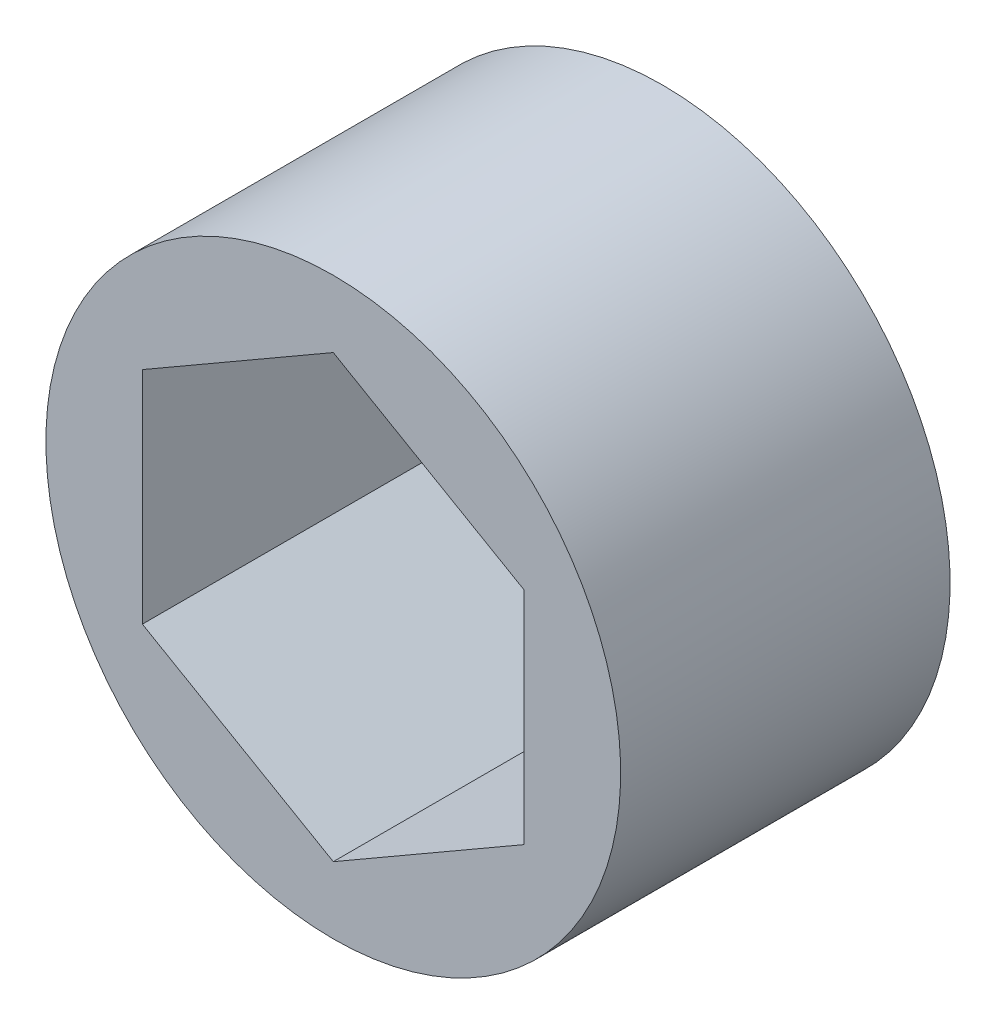
ISO-10303-21;
HEADER;
FILE_DESCRIPTION(('STEP AP214'),'2;1');
FILE_NAME('part.step','',(''),(''),'','','');
FILE_SCHEMA(('AUTOMOTIVE_DESIGN { 1 0 10303 214 1 1 1 1 }'));
ENDSEC;
DATA;
#1=APPLICATION_CONTEXT('core data for automotive mechanical design processes');
#2=APPLICATION_PROTOCOL_DEFINITION('international standard','automotive_design',2000,#1);
#3=PRODUCT_CONTEXT('',#1,'mechanical');
#4=PRODUCT('Part','Part','',(#3));
#5=PRODUCT_RELATED_PRODUCT_CATEGORY('part','',(#4));
#6=PRODUCT_DEFINITION_FORMATION('','',#4);
#7=PRODUCT_DEFINITION_CONTEXT('part definition',#1,'design');
#8=PRODUCT_DEFINITION('design','',#6,#7);
#9=PRODUCT_DEFINITION_SHAPE('','',#8);
#10=(LENGTH_UNIT() NAMED_UNIT(*) SI_UNIT(.MILLI.,.METRE.));
#11=(NAMED_UNIT(*) PLANE_ANGLE_UNIT() SI_UNIT($,.RADIAN.));
#12=(NAMED_UNIT(*) SI_UNIT($,.STERADIAN.) SOLID_ANGLE_UNIT());
#13=UNCERTAINTY_MEASURE_WITH_UNIT(LENGTH_MEASURE(1.E-05),#10,'distance_accuracy_value','');
#14=(GEOMETRIC_REPRESENTATION_CONTEXT(3) GLOBAL_UNCERTAINTY_ASSIGNED_CONTEXT((#13)) GLOBAL_UNIT_ASSIGNED_CONTEXT((#10,
#11,#12)) REPRESENTATION_CONTEXT('',''));
#15=CARTESIAN_POINT('',(0.,0.,0.));
#16=DIRECTION('',(0.,0.,1.));
#17=DIRECTION('',(1.,0.,0.));
#18=AXIS2_PLACEMENT_3D('',#15,#16,#17);
#19=CARTESIAN_POINT('',(0.,1.02805625123992E-13,9.58849999999959));
#20=DIRECTION('',(0.,0.,-1.));
#21=DIRECTION('',(0.,1.,0.));
#22=AXIS2_PLACEMENT_3D('',#19,#20,#21);
#23=CYLINDRICAL_SURFACE('',#22,9.75000000000008);
#24=CARTESIAN_POINT('',(0.,1.02805625123992E-13,9.58849999999959));
#25=DIRECTION('',(0.,0.,-1.));
#26=DIRECTION('',(0.,-1.,0.));
#27=AXIS2_PLACEMENT_3D('',#24,#25,#26);
#28=CIRCLE('',#27,9.75000000000008);
#29=CARTESIAN_POINT('',(0.,-9.74999999999997,9.58849999999958));
#30=VERTEX_POINT('',#29);
#31=EDGE_CURVE('E11',#30,#30,#28,.T.);
#32=ORIENTED_EDGE('',*,*,#31,.T.);
#33=EDGE_LOOP('',(#32));
#34=FACE_BOUND('',#33,.T.);
#35=CARTESIAN_POINT('',(0.,1.14282888707962E-13,-1.58750000000041));
#36=DIRECTION('',(0.,0.,-1.));
#37=DIRECTION('',(0.,-1.,0.));
#38=AXIS2_PLACEMENT_3D('',#35,#36,#37);
#39=CIRCLE('',#38,9.75000000000008);
#40=CARTESIAN_POINT('',(0.,-9.74999999999996,-1.58750000000042));
#41=VERTEX_POINT('',#40);
#42=EDGE_CURVE('E42',#41,#41,#39,.T.);
#43=ORIENTED_EDGE('',*,*,#42,.F.);
#44=EDGE_LOOP('',(#43));
#45=FACE_BOUND('',#44,.T.);
#46=ADVANCED_FACE('F39',(#34,#45),#23,.T.);
#47=CARTESIAN_POINT('',(0.,1.02805625123992E-13,9.58849999999959));
#48=DIRECTION('',(0.,0.,1.));
#49=DIRECTION('',(0.,-1.,0.));
#50=AXIS2_PLACEMENT_3D('',#47,#48,#49);
#51=PLANE('',#50);
#52=DIRECTION('',(0.866025403784435,0.500000000000007,0.));
#53=VECTOR('',#52,1.);
#54=CARTESIAN_POINT('',(1.03382859055236E-13,7.47899538708265,9.5884999999996));
#55=LINE('',#54,#53);
#56=CARTESIAN_POINT('',(-6.47699999999994,3.73949769354135,9.58849999999959));
#57=VERTEX_POINT('',#56);
#58=CARTESIAN_POINT('',(1.03382859055236E-13,7.47899538708265,9.5884999999996));
#59=VERTEX_POINT('',#58);
#60=EDGE_CURVE('E94',#57,#59,#55,.T.);
#61=ORIENTED_EDGE('',*,*,#60,.T.);
#62=DIRECTION('',(0.866025403784438,-0.500000000000001,0.));
#63=VECTOR('',#62,1.);
#64=CARTESIAN_POINT('',(6.47700000000005,3.73949769354146,9.5884999999996));
#65=LINE('',#64,#63);
#66=CARTESIAN_POINT('',(6.47700000000006,3.73949769354145,9.5884999999996));
#67=VERTEX_POINT('',#66);
#68=EDGE_CURVE('E104',#59,#67,#65,.T.);
#69=ORIENTED_EDGE('',*,*,#68,.T.);
#70=DIRECTION('',(0.,-1.,0.));
#71=VECTOR('',#70,1.);
#72=CARTESIAN_POINT('',(6.47700000000004,-3.73949769354104,9.58849999999959));
#73=LINE('',#72,#71);
#74=CARTESIAN_POINT('',(6.47700000000004,-3.73949769354104,9.58849999999959));
#75=VERTEX_POINT('',#74);
#76=EDGE_CURVE('E54',#67,#75,#73,.T.);
#77=ORIENTED_EDGE('',*,*,#76,.T.);
#78=DIRECTION('',(-0.866025403784445,-0.499999999999989,0.));
#79=VECTOR('',#78,1.);
#80=CARTESIAN_POINT('',(1.80676701057685E-13,-7.47899538708206,9.58849999999959));
#81=LINE('',#80,#79);
#82=CARTESIAN_POINT('',(1.80676701057685E-13,-7.47899538708206,9.58849999999959));
#83=VERTEX_POINT('',#82);
#84=EDGE_CURVE('E123',#75,#83,#81,.T.);
#85=ORIENTED_EDGE('',*,*,#84,.T.);
#86=DIRECTION('',(-0.866025403784448,0.499999999999984,0.));
#87=VECTOR('',#86,1.);
#88=CARTESIAN_POINT('',(-6.47699999999996,-3.73949769354093,9.58849999999959));
#89=LINE('',#88,#87);
#90=CARTESIAN_POINT('',(-6.47699999999996,-3.73949769354093,9.58849999999959));
#91=VERTEX_POINT('',#90);
#92=EDGE_CURVE('E127',#83,#91,#89,.T.);
#93=ORIENTED_EDGE('',*,*,#92,.T.);
#94=DIRECTION('',(0.,1.,0.));
#95=VECTOR('',#94,1.);
#96=CARTESIAN_POINT('',(-6.47699999999994,3.73949769354135,9.58849999999959));
#97=LINE('',#96,#95);
#98=EDGE_CURVE('E101',#91,#57,#97,.T.);
#99=ORIENTED_EDGE('',*,*,#98,.T.);
#100=EDGE_LOOP('',(#61,#69,#77,#85,#93,#99));
#101=FACE_BOUND('',#100,.T.);
#102=ORIENTED_EDGE('',*,*,#31,.F.);
#103=EDGE_LOOP('',(#102));
#104=FACE_BOUND('',#103,.T.);
#105=ADVANCED_FACE('F109',(#101,#104),#51,.T.);
#106=CARTESIAN_POINT('',(0.,1.14282888707962E-13,-1.58750000000041));
#107=DIRECTION('',(0.,0.,1.));
#108=DIRECTION('',(0.,-1.,0.));
#109=AXIS2_PLACEMENT_3D('',#106,#107,#108);
#110=PLANE('',#109);
#111=DIRECTION('',(0.866025403784438,-0.500000000000001,0.));
#112=VECTOR('',#111,1.);
#113=CARTESIAN_POINT('',(6.47700000000006,3.73949769354147,-1.5875000000004));
#114=LINE('',#113,#112);
#115=CARTESIAN_POINT('',(1.03649727689614E-13,7.47899538708266,-1.5875000000004));
#116=VERTEX_POINT('',#115);
#117=CARTESIAN_POINT('',(6.47700000000006,3.73949769354147,-1.5875000000004));
#118=VERTEX_POINT('',#117);
#119=EDGE_CURVE('E134',#116,#118,#114,.T.);
#120=ORIENTED_EDGE('',*,*,#119,.F.);
#121=DIRECTION('',(0.866025403784435,0.500000000000007,0.));
#122=VECTOR('',#121,1.);
#123=CARTESIAN_POINT('',(1.0834600006452E-13,7.47899538708266,-1.5875000000004));
#124=LINE('',#123,#122);
#125=CARTESIAN_POINT('',(-6.47699999999994,3.73949769354136,-1.58750000000041));
#126=VERTEX_POINT('',#125);
#127=EDGE_CURVE('E62',#126,#116,#124,.T.);
#128=ORIENTED_EDGE('',*,*,#127,.F.);
#129=DIRECTION('',(0.,1.,0.));
#130=VECTOR('',#129,1.);
#131=CARTESIAN_POINT('',(-6.47699999999994,3.73949769354136,-1.58750000000041));
#132=LINE('',#131,#130);
#133=CARTESIAN_POINT('',(-6.47699999999995,-3.73949769354091,-1.58750000000041));
#134=VERTEX_POINT('',#133);
#135=EDGE_CURVE('E114',#134,#126,#132,.T.);
#136=ORIENTED_EDGE('',*,*,#135,.F.);
#137=DIRECTION('',(-0.866025403784448,0.499999999999984,0.));
#138=VECTOR('',#137,1.);
#139=CARTESIAN_POINT('',(-6.47699999999995,-3.73949769354091,-1.58750000000041));
#140=LINE('',#139,#138);
#141=CARTESIAN_POINT('',(1.85639842066969E-13,-7.47899538708204,-1.58750000000042));
#142=VERTEX_POINT('',#141);
#143=EDGE_CURVE('E118',#142,#134,#140,.T.);
#144=ORIENTED_EDGE('',*,*,#143,.F.);
#145=DIRECTION('',(-0.866025403784445,-0.499999999999989,0.));
#146=VECTOR('',#145,1.);
#147=CARTESIAN_POINT('',(1.85639842066969E-13,-7.47899538708204,-1.58750000000042));
#148=LINE('',#147,#146);
#149=CARTESIAN_POINT('',(6.47700000000004,-3.73949769354103,-1.58750000000041));
#150=VERTEX_POINT('',#149);
#151=EDGE_CURVE('E141',#150,#142,#148,.T.);
#152=ORIENTED_EDGE('',*,*,#151,.F.);
#153=DIRECTION('',(0.,-1.,0.));
#154=VECTOR('',#153,1.);
#155=CARTESIAN_POINT('',(6.47700000000004,-3.73949769354103,-1.58750000000041));
#156=LINE('',#155,#154);
#157=EDGE_CURVE('E137',#118,#150,#156,.T.);
#158=ORIENTED_EDGE('',*,*,#157,.F.);
#159=EDGE_LOOP('',(#120,#128,#136,#144,#152,#158));
#160=FACE_BOUND('',#159,.T.);
#161=ORIENTED_EDGE('',*,*,#42,.T.);
#162=EDGE_LOOP('',(#161));
#163=FACE_BOUND('',#162,.T.);
#164=ADVANCED_FACE('F165',(#160,#163),#110,.F.);
#165=CARTESIAN_POINT('',(1.03382859055236E-13,7.47899538708265,9.5884999999996));
#166=DIRECTION('',(-0.500000000000006,0.866025403784435,0.));
#167=DIRECTION('',(-0.866025403784435,-0.500000000000006,0.));
#168=AXIS2_PLACEMENT_3D('',#165,#166,#167);
#169=PLANE('',#168);
#170=ORIENTED_EDGE('',*,*,#127,.T.);
#171=DIRECTION('',(0.,0.,-1.));
#172=VECTOR('',#171,1.);
#173=CARTESIAN_POINT('',(1.03382859055236E-13,7.47899538708265,9.5884999999996));
#174=LINE('',#173,#172);
#175=EDGE_CURVE('E90',#59,#116,#174,.T.);
#176=ORIENTED_EDGE('',*,*,#175,.F.);
#177=ORIENTED_EDGE('',*,*,#60,.F.);
#178=DIRECTION('',(0.,0.,-1.));
#179=VECTOR('',#178,1.);
#180=CARTESIAN_POINT('',(-6.47699999999994,3.73949769354135,9.58849999999959));
#181=LINE('',#180,#179);
#182=EDGE_CURVE('E148',#57,#126,#181,.T.);
#183=ORIENTED_EDGE('',*,*,#182,.T.);
#184=EDGE_LOOP('',(#170,#176,#177,#183));
#185=FACE_BOUND('',#184,.T.);
#186=ADVANCED_FACE('F92',(#185),#169,.F.);
#187=CARTESIAN_POINT('',(-6.47699999999994,3.73949769354135,9.58849999999959));
#188=DIRECTION('',(-1.,0.,0.));
#189=DIRECTION('',(0.,-1.,0.));
#190=AXIS2_PLACEMENT_3D('',#187,#188,#189);
#191=PLANE('',#190);
#192=ORIENTED_EDGE('',*,*,#135,.T.);
#193=ORIENTED_EDGE('',*,*,#182,.F.);
#194=ORIENTED_EDGE('',*,*,#98,.F.);
#195=DIRECTION('',(0.,0.,-1.));
#196=VECTOR('',#195,1.);
#197=CARTESIAN_POINT('',(-6.47699999999996,-3.73949769354093,9.58849999999959));
#198=LINE('',#197,#196);
#199=EDGE_CURVE('E151',#91,#134,#198,.T.);
#200=ORIENTED_EDGE('',*,*,#199,.T.);
#201=EDGE_LOOP('',(#192,#193,#194,#200));
#202=FACE_BOUND('',#201,.T.);
#203=ADVANCED_FACE('F176',(#202),#191,.F.);
#204=CARTESIAN_POINT('',(-6.47699999999996,-3.73949769354093,9.58849999999959));
#205=DIRECTION('',(-0.499999999999984,-0.866025403784448,0.));
#206=DIRECTION('',(0.866025403784448,-0.499999999999984,0.));
#207=AXIS2_PLACEMENT_3D('',#204,#205,#206);
#208=PLANE('',#207);
#209=ORIENTED_EDGE('',*,*,#143,.T.);
#210=ORIENTED_EDGE('',*,*,#199,.F.);
#211=ORIENTED_EDGE('',*,*,#92,.F.);
#212=DIRECTION('',(0.,0.,-1.));
#213=VECTOR('',#212,1.);
#214=CARTESIAN_POINT('',(1.80676701057685E-13,-7.47899538708206,9.58849999999959));
#215=LINE('',#214,#213);
#216=EDGE_CURVE('E154',#83,#142,#215,.T.);
#217=ORIENTED_EDGE('',*,*,#216,.T.);
#218=EDGE_LOOP('',(#209,#210,#211,#217));
#219=FACE_BOUND('',#218,.T.);
#220=ADVANCED_FACE('F174',(#219),#208,.F.);
#221=CARTESIAN_POINT('',(1.80676701057685E-13,-7.47899538708206,9.58849999999959));
#222=DIRECTION('',(0.499999999999989,-0.866025403784445,0.));
#223=DIRECTION('',(0.866025403784445,0.499999999999989,0.));
#224=AXIS2_PLACEMENT_3D('',#221,#222,#223);
#225=PLANE('',#224);
#226=ORIENTED_EDGE('',*,*,#151,.T.);
#227=ORIENTED_EDGE('',*,*,#216,.F.);
#228=ORIENTED_EDGE('',*,*,#84,.F.);
#229=DIRECTION('',(0.,0.,-1.));
#230=VECTOR('',#229,1.);
#231=CARTESIAN_POINT('',(6.47700000000004,-3.73949769354104,9.58849999999959));
#232=LINE('',#231,#230);
#233=EDGE_CURVE('E157',#75,#150,#232,.T.);
#234=ORIENTED_EDGE('',*,*,#233,.T.);
#235=EDGE_LOOP('',(#226,#227,#228,#234));
#236=FACE_BOUND('',#235,.T.);
#237=ADVANCED_FACE('F170',(#236),#225,.F.);
#238=CARTESIAN_POINT('',(6.47700000000004,-3.73949769354104,9.58849999999959));
#239=DIRECTION('',(1.,0.,0.));
#240=DIRECTION('',(0.,1.,0.));
#241=AXIS2_PLACEMENT_3D('',#238,#239,#240);
#242=PLANE('',#241);
#243=ORIENTED_EDGE('',*,*,#157,.T.);
#244=ORIENTED_EDGE('',*,*,#233,.F.);
#245=ORIENTED_EDGE('',*,*,#76,.F.);
#246=DIRECTION('',(0.,0.,-1.));
#247=VECTOR('',#246,1.);
#248=CARTESIAN_POINT('',(6.47700000000005,3.73949769354146,9.5884999999996));
#249=LINE('',#248,#247);
#250=EDGE_CURVE('E100',#67,#118,#249,.T.);
#251=ORIENTED_EDGE('',*,*,#250,.T.);
#252=EDGE_LOOP('',(#243,#244,#245,#251));
#253=FACE_BOUND('',#252,.T.);
#254=ADVANCED_FACE('F161',(#253),#242,.F.);
#255=CARTESIAN_POINT('',(6.47700000000005,3.73949769354146,9.5884999999996));
#256=DIRECTION('',(0.500000000000001,0.866025403784438,0.));
#257=DIRECTION('',(-0.866025403784438,0.500000000000001,0.));
#258=AXIS2_PLACEMENT_3D('',#255,#256,#257);
#259=PLANE('',#258);
#260=ORIENTED_EDGE('',*,*,#119,.T.);
#261=ORIENTED_EDGE('',*,*,#250,.F.);
#262=ORIENTED_EDGE('',*,*,#68,.F.);
#263=ORIENTED_EDGE('',*,*,#175,.T.);
#264=EDGE_LOOP('',(#260,#261,#262,#263));
#265=FACE_BOUND('',#264,.T.);
#266=ADVANCED_FACE('F105',(#265),#259,.F.);
#267=CLOSED_SHELL('',(#46,#105,#164,#186,#203,#220,#237,#254,#266));
#268=MANIFOLD_SOLID_BREP('B2',#267);
#269=ADVANCED_BREP_SHAPE_REPRESENTATION('',(#18,#268),#14);
#270=SHAPE_DEFINITION_REPRESENTATION(#9,#269);
ENDSEC;
END-ISO-10303-21;
